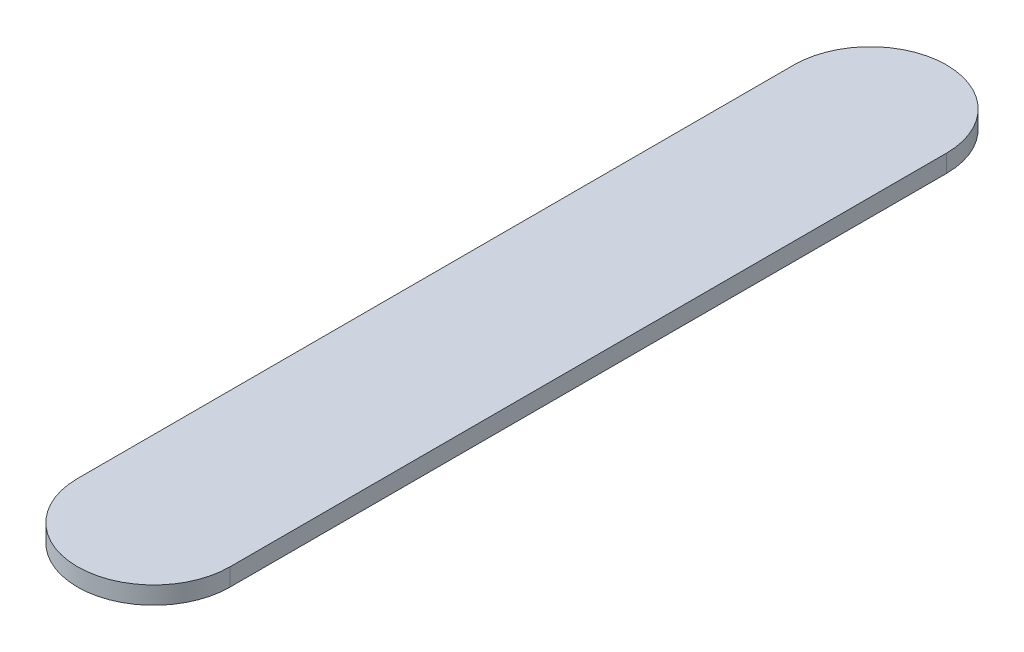
ISO-10303-21;
HEADER;
FILE_DESCRIPTION(('STEP AP214'),'2;1');
FILE_NAME('part.step','',(''),(''),'','','');
FILE_SCHEMA(('AUTOMOTIVE_DESIGN { 1 0 10303 214 1 1 1 1 }'));
ENDSEC;
DATA;
#1=APPLICATION_CONTEXT('core data for automotive mechanical design processes');
#2=APPLICATION_PROTOCOL_DEFINITION('international standard','automotive_design',2000,#1);
#3=PRODUCT_CONTEXT('',#1,'mechanical');
#4=PRODUCT('Part','Part','',(#3));
#5=PRODUCT_RELATED_PRODUCT_CATEGORY('part','',(#4));
#6=PRODUCT_DEFINITION_FORMATION('','',#4);
#7=PRODUCT_DEFINITION_CONTEXT('part definition',#1,'design');
#8=PRODUCT_DEFINITION('design','',#6,#7);
#9=PRODUCT_DEFINITION_SHAPE('','',#8);
#10=(LENGTH_UNIT() NAMED_UNIT(*) SI_UNIT(.MILLI.,.METRE.));
#11=(NAMED_UNIT(*) PLANE_ANGLE_UNIT() SI_UNIT($,.RADIAN.));
#12=(NAMED_UNIT(*) SI_UNIT($,.STERADIAN.) SOLID_ANGLE_UNIT());
#13=UNCERTAINTY_MEASURE_WITH_UNIT(LENGTH_MEASURE(1.E-05),#10,'distance_accuracy_value','');
#14=(GEOMETRIC_REPRESENTATION_CONTEXT(3) GLOBAL_UNCERTAINTY_ASSIGNED_CONTEXT((#13)) GLOBAL_UNIT_ASSIGNED_CONTEXT((#10,
#11,#12)) REPRESENTATION_CONTEXT('',''));
#15=CARTESIAN_POINT('',(0.,0.,0.));
#16=DIRECTION('',(0.,0.,1.));
#17=DIRECTION('',(1.,0.,0.));
#18=AXIS2_PLACEMENT_3D('',#15,#16,#17);
#19=CARTESIAN_POINT('',(0.,1.5,30.5));
#20=DIRECTION('',(0.,-1.,0.));
#21=DIRECTION('',(0.,0.,-1.));
#22=AXIS2_PLACEMENT_3D('',#19,#20,#21);
#23=CYLINDRICAL_SURFACE('',#22,6.50000000000001);
#24=CARTESIAN_POINT('',(0.,0.,30.5));
#25=DIRECTION('',(0.,1.,0.));
#26=DIRECTION('',(0.,0.,1.));
#27=AXIS2_PLACEMENT_3D('',#24,#25,#26);
#28=CIRCLE('',#27,6.50000000000001);
#29=CARTESIAN_POINT('',(-6.50000000000001,0.,30.5));
#30=VERTEX_POINT('',#29);
#31=CARTESIAN_POINT('',(6.50000000000001,0.,30.5));
#32=VERTEX_POINT('',#31);
#33=EDGE_CURVE('E98',#30,#32,#28,.T.);
#34=ORIENTED_EDGE('',*,*,#33,.T.);
#35=DIRECTION('',(0.,-1.,0.));
#36=VECTOR('',#35,1.);
#37=CARTESIAN_POINT('',(6.50000000000001,1.5,30.5));
#38=LINE('',#37,#36);
#39=CARTESIAN_POINT('',(6.50000000000001,1.5,30.5));
#40=VERTEX_POINT('',#39);
#41=EDGE_CURVE('E11',#40,#32,#38,.T.);
#42=ORIENTED_EDGE('',*,*,#41,.F.);
#43=CARTESIAN_POINT('',(0.,1.5,30.5));
#44=DIRECTION('',(0.,1.,0.));
#45=DIRECTION('',(0.,0.,1.));
#46=AXIS2_PLACEMENT_3D('',#43,#44,#45);
#47=CIRCLE('',#46,6.50000000000001);
#48=CARTESIAN_POINT('',(-6.50000000000001,1.5,30.5));
#49=VERTEX_POINT('',#48);
#50=EDGE_CURVE('E86',#49,#40,#47,.T.);
#51=ORIENTED_EDGE('',*,*,#50,.F.);
#52=DIRECTION('',(0.,-1.,0.));
#53=VECTOR('',#52,1.);
#54=CARTESIAN_POINT('',(-6.50000000000001,1.5,30.5));
#55=LINE('',#54,#53);
#56=EDGE_CURVE('E94',#49,#30,#55,.T.);
#57=ORIENTED_EDGE('',*,*,#56,.T.);
#58=EDGE_LOOP('',(#34,#42,#51,#57));
#59=FACE_BOUND('',#58,.T.);
#60=ADVANCED_FACE('F35',(#59),#23,.T.);
#61=CARTESIAN_POINT('',(6.5,1.5,-30.5));
#62=DIRECTION('',(-1.,0.,0.));
#63=DIRECTION('',(0.,0.,1.));
#64=AXIS2_PLACEMENT_3D('',#61,#62,#63);
#65=PLANE('',#64);
#66=DIRECTION('',(0.,0.,-1.));
#67=VECTOR('',#66,1.);
#68=CARTESIAN_POINT('',(6.5,0.,-30.5));
#69=LINE('',#68,#67);
#70=CARTESIAN_POINT('',(6.50000000000001,0.,-30.5));
#71=VERTEX_POINT('',#70);
#72=EDGE_CURVE('E90',#32,#71,#69,.T.);
#73=ORIENTED_EDGE('',*,*,#72,.T.);
#74=DIRECTION('',(0.,-1.,0.));
#75=VECTOR('',#74,1.);
#76=CARTESIAN_POINT('',(6.50000000000001,1.5,-30.5));
#77=LINE('',#76,#75);
#78=CARTESIAN_POINT('',(6.50000000000001,1.5,-30.5));
#79=VERTEX_POINT('',#78);
#80=EDGE_CURVE('E43',#79,#71,#77,.T.);
#81=ORIENTED_EDGE('',*,*,#80,.F.);
#82=DIRECTION('',(0.,0.,-1.));
#83=VECTOR('',#82,1.);
#84=CARTESIAN_POINT('',(6.5,1.5,-30.5));
#85=LINE('',#84,#83);
#86=EDGE_CURVE('E81',#40,#79,#85,.T.);
#87=ORIENTED_EDGE('',*,*,#86,.F.);
#88=ORIENTED_EDGE('',*,*,#41,.T.);
#89=EDGE_LOOP('',(#73,#81,#87,#88));
#90=FACE_BOUND('',#89,.T.);
#91=ADVANCED_FACE('F89',(#90),#65,.F.);
#92=CARTESIAN_POINT('',(0.,1.5,-30.5));
#93=DIRECTION('',(0.,-1.,0.));
#94=DIRECTION('',(0.,0.,-1.));
#95=AXIS2_PLACEMENT_3D('',#92,#93,#94);
#96=CYLINDRICAL_SURFACE('',#95,6.50000000000001);
#97=CARTESIAN_POINT('',(0.,0.,-30.5));
#98=DIRECTION('',(0.,1.,0.));
#99=DIRECTION('',(0.,0.,1.));
#100=AXIS2_PLACEMENT_3D('',#97,#98,#99);
#101=CIRCLE('',#100,6.50000000000001);
#102=CARTESIAN_POINT('',(-6.50000000000002,0.,-30.5));
#103=VERTEX_POINT('',#102);
#104=EDGE_CURVE('E68',#71,#103,#101,.T.);
#105=ORIENTED_EDGE('',*,*,#104,.T.);
#106=DIRECTION('',(0.,-1.,0.));
#107=VECTOR('',#106,1.);
#108=CARTESIAN_POINT('',(-6.50000000000002,1.5,-30.5));
#109=LINE('',#108,#107);
#110=CARTESIAN_POINT('',(-6.50000000000002,1.5,-30.5));
#111=VERTEX_POINT('',#110);
#112=EDGE_CURVE('E91',#111,#103,#109,.T.);
#113=ORIENTED_EDGE('',*,*,#112,.F.);
#114=CARTESIAN_POINT('',(0.,1.5,-30.5));
#115=DIRECTION('',(0.,1.,0.));
#116=DIRECTION('',(0.,0.,1.));
#117=AXIS2_PLACEMENT_3D('',#114,#115,#116);
#118=CIRCLE('',#117,6.50000000000001);
#119=EDGE_CURVE('E84',#79,#111,#118,.T.);
#120=ORIENTED_EDGE('',*,*,#119,.F.);
#121=ORIENTED_EDGE('',*,*,#80,.T.);
#122=EDGE_LOOP('',(#105,#113,#120,#121));
#123=FACE_BOUND('',#122,.T.);
#124=ADVANCED_FACE('F92',(#123),#96,.T.);
#125=CARTESIAN_POINT('',(-6.50000000000002,1.5,-30.5));
#126=DIRECTION('',(1.,0.,0.));
#127=DIRECTION('',(0.,0.,-1.));
#128=AXIS2_PLACEMENT_3D('',#125,#126,#127);
#129=PLANE('',#128);
#130=DIRECTION('',(0.,0.,1.));
#131=VECTOR('',#130,1.);
#132=CARTESIAN_POINT('',(-6.50000000000002,0.,-30.5));
#133=LINE('',#132,#131);
#134=EDGE_CURVE('E74',#103,#30,#133,.T.);
#135=ORIENTED_EDGE('',*,*,#134,.T.);
#136=ORIENTED_EDGE('',*,*,#56,.F.);
#137=DIRECTION('',(0.,0.,1.));
#138=VECTOR('',#137,1.);
#139=CARTESIAN_POINT('',(-6.50000000000002,1.5,-30.5));
#140=LINE('',#139,#138);
#141=EDGE_CURVE('E51',#111,#49,#140,.T.);
#142=ORIENTED_EDGE('',*,*,#141,.F.);
#143=ORIENTED_EDGE('',*,*,#112,.T.);
#144=EDGE_LOOP('',(#135,#136,#142,#143));
#145=FACE_BOUND('',#144,.T.);
#146=ADVANCED_FACE('F105',(#145),#129,.F.);
#147=CARTESIAN_POINT('',(0.,1.5,30.5));
#148=DIRECTION('',(0.,1.,0.));
#149=DIRECTION('',(0.,0.,1.));
#150=AXIS2_PLACEMENT_3D('',#147,#148,#149);
#151=PLANE('',#150);
#152=ORIENTED_EDGE('',*,*,#50,.T.);
#153=ORIENTED_EDGE('',*,*,#86,.T.);
#154=ORIENTED_EDGE('',*,*,#119,.T.);
#155=ORIENTED_EDGE('',*,*,#141,.T.);
#156=EDGE_LOOP('',(#152,#153,#154,#155));
#157=FACE_BOUND('',#156,.T.);
#158=ADVANCED_FACE('F82',(#157),#151,.T.);
#159=CARTESIAN_POINT('',(0.,0.,30.5));
#160=DIRECTION('',(0.,1.,0.));
#161=DIRECTION('',(0.,0.,1.));
#162=AXIS2_PLACEMENT_3D('',#159,#160,#161);
#163=PLANE('',#162);
#164=ORIENTED_EDGE('',*,*,#33,.F.);
#165=ORIENTED_EDGE('',*,*,#134,.F.);
#166=ORIENTED_EDGE('',*,*,#104,.F.);
#167=ORIENTED_EDGE('',*,*,#72,.F.);
#168=EDGE_LOOP('',(#164,#165,#166,#167));
#169=FACE_BOUND('',#168,.T.);
#170=ADVANCED_FACE('F108',(#169),#163,.F.);
#171=CLOSED_SHELL('',(#60,#91,#124,#146,#158,#170));
#172=MANIFOLD_SOLID_BREP('B2',#171);
#173=ADVANCED_BREP_SHAPE_REPRESENTATION('',(#18,#172),#14);
#174=SHAPE_DEFINITION_REPRESENTATION(#9,#173);
ENDSEC;
END-ISO-10303-21;
